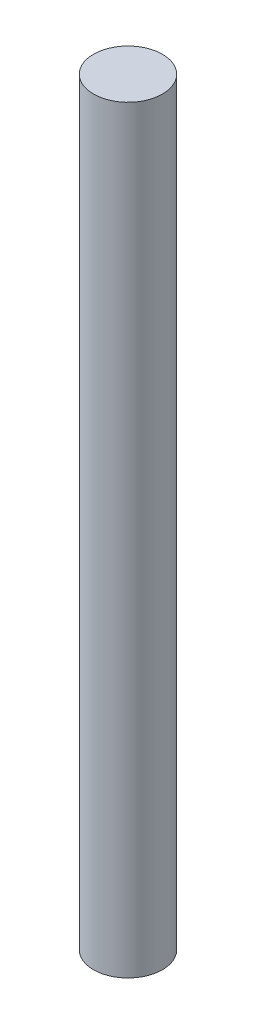
ISO-10303-21;
HEADER;
FILE_DESCRIPTION(('STEP AP214'),'2;1');
FILE_NAME('part.step','',(''),(''),'','','');
FILE_SCHEMA(('AUTOMOTIVE_DESIGN { 1 0 10303 214 1 1 1 1 }'));
ENDSEC;
DATA;
#1=APPLICATION_CONTEXT('core data for automotive mechanical design processes');
#2=APPLICATION_PROTOCOL_DEFINITION('international standard','automotive_design',2000,#1);
#3=PRODUCT_CONTEXT('',#1,'mechanical');
#4=PRODUCT('Part','Part','',(#3));
#5=PRODUCT_RELATED_PRODUCT_CATEGORY('part','',(#4));
#6=PRODUCT_DEFINITION_FORMATION('','',#4);
#7=PRODUCT_DEFINITION_CONTEXT('part definition',#1,'design');
#8=PRODUCT_DEFINITION('design','',#6,#7);
#9=PRODUCT_DEFINITION_SHAPE('','',#8);
#10=(LENGTH_UNIT() NAMED_UNIT(*) SI_UNIT(.MILLI.,.METRE.));
#11=(NAMED_UNIT(*) PLANE_ANGLE_UNIT() SI_UNIT($,.RADIAN.));
#12=(NAMED_UNIT(*) SI_UNIT($,.STERADIAN.) SOLID_ANGLE_UNIT());
#13=UNCERTAINTY_MEASURE_WITH_UNIT(LENGTH_MEASURE(1.E-05),#10,'distance_accuracy_value','');
#14=(GEOMETRIC_REPRESENTATION_CONTEXT(3) GLOBAL_UNCERTAINTY_ASSIGNED_CONTEXT((#13)) GLOBAL_UNIT_ASSIGNED_CONTEXT((#10,
#11,#12)) REPRESENTATION_CONTEXT('',''));
#15=CARTESIAN_POINT('',(0.,0.,0.));
#16=DIRECTION('',(0.,0.,1.));
#17=DIRECTION('',(1.,0.,0.));
#18=AXIS2_PLACEMENT_3D('',#15,#16,#17);
#19=CARTESIAN_POINT('',(0.,139.7,0.));
#20=DIRECTION('',(0.,-1.,0.));
#21=DIRECTION('',(0.,0.,-1.));
#22=AXIS2_PLACEMENT_3D('',#19,#20,#21);
#23=CYLINDRICAL_SURFACE('',#22,12.7);
#24=CARTESIAN_POINT('',(0.,139.7,0.));
#25=DIRECTION('',(0.,1.,0.));
#26=DIRECTION('',(0.,0.,1.));
#27=AXIS2_PLACEMENT_3D('',#24,#25,#26);
#28=CIRCLE('',#27,12.7);
#29=CARTESIAN_POINT('',(0.,139.7,12.7));
#30=VERTEX_POINT('',#29);
#31=EDGE_CURVE('E10',#30,#30,#28,.T.);
#32=ORIENTED_EDGE('',*,*,#31,.F.);
#33=EDGE_LOOP('',(#32));
#34=FACE_BOUND('',#33,.T.);
#35=CARTESIAN_POINT('',(0.,-139.7,0.));
#36=DIRECTION('',(0.,1.,0.));
#37=DIRECTION('',(0.,0.,1.));
#38=AXIS2_PLACEMENT_3D('',#35,#36,#37);
#39=CIRCLE('',#38,12.7);
#40=CARTESIAN_POINT('',(0.,-139.7,12.7));
#41=VERTEX_POINT('',#40);
#42=EDGE_CURVE('E44',#41,#41,#39,.T.);
#43=ORIENTED_EDGE('',*,*,#42,.T.);
#44=EDGE_LOOP('',(#43));
#45=FACE_BOUND('',#44,.T.);
#46=ADVANCED_FACE('F41',(#34,#45),#23,.T.);
#47=CARTESIAN_POINT('',(0.,139.7,0.));
#48=DIRECTION('',(0.,1.,0.));
#49=DIRECTION('',(0.,0.,1.));
#50=AXIS2_PLACEMENT_3D('',#47,#48,#49);
#51=PLANE('',#50);
#52=ORIENTED_EDGE('',*,*,#31,.T.);
#53=EDGE_LOOP('',(#52));
#54=FACE_BOUND('',#53,.T.);
#55=ADVANCED_FACE('F58',(#54),#51,.T.);
#56=CARTESIAN_POINT('',(0.,-139.7,0.));
#57=DIRECTION('',(0.,1.,0.));
#58=DIRECTION('',(0.,0.,1.));
#59=AXIS2_PLACEMENT_3D('',#56,#57,#58);
#60=PLANE('',#59);
#61=ORIENTED_EDGE('',*,*,#42,.F.);
#62=EDGE_LOOP('',(#61));
#63=FACE_BOUND('',#62,.T.);
#64=ADVANCED_FACE('F56',(#63),#60,.F.);
#65=CLOSED_SHELL('',(#46,#55,#64));
#66=MANIFOLD_SOLID_BREP('B2',#65);
#67=ADVANCED_BREP_SHAPE_REPRESENTATION('',(#18,#66),#14);
#68=SHAPE_DEFINITION_REPRESENTATION(#9,#67);
ENDSEC;
END-ISO-10303-21;
